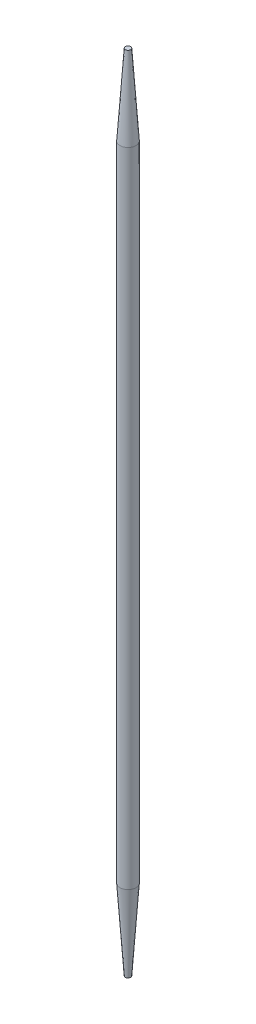
ISO-10303-21;
HEADER;
FILE_DESCRIPTION(('STEP AP214'),'2;1');
FILE_NAME('part.step','',(''),(''),'','','');
FILE_SCHEMA(('AUTOMOTIVE_DESIGN { 1 0 10303 214 1 1 1 1 }'));
ENDSEC;
DATA;
#1=APPLICATION_CONTEXT('core data for automotive mechanical design processes');
#2=APPLICATION_PROTOCOL_DEFINITION('international standard','automotive_design',2000,#1);
#3=PRODUCT_CONTEXT('',#1,'mechanical');
#4=PRODUCT('Part','Part','',(#3));
#5=PRODUCT_RELATED_PRODUCT_CATEGORY('part','',(#4));
#6=PRODUCT_DEFINITION_FORMATION('','',#4);
#7=PRODUCT_DEFINITION_CONTEXT('part definition',#1,'design');
#8=PRODUCT_DEFINITION('design','',#6,#7);
#9=PRODUCT_DEFINITION_SHAPE('','',#8);
#10=(LENGTH_UNIT() NAMED_UNIT(*) SI_UNIT(.MILLI.,.METRE.));
#11=(NAMED_UNIT(*) PLANE_ANGLE_UNIT() SI_UNIT($,.RADIAN.));
#12=(NAMED_UNIT(*) SI_UNIT($,.STERADIAN.) SOLID_ANGLE_UNIT());
#13=UNCERTAINTY_MEASURE_WITH_UNIT(LENGTH_MEASURE(1.E-05),#10,'distance_accuracy_value','');
#14=(GEOMETRIC_REPRESENTATION_CONTEXT(3) GLOBAL_UNCERTAINTY_ASSIGNED_CONTEXT((#13)) GLOBAL_UNIT_ASSIGNED_CONTEXT((#10,
#11,#12)) REPRESENTATION_CONTEXT('',''));
#15=CARTESIAN_POINT('',(0.,0.,0.));
#16=DIRECTION('',(0.,0.,1.));
#17=DIRECTION('',(1.,0.,0.));
#18=AXIS2_PLACEMENT_3D('',#15,#16,#17);
#19=CARTESIAN_POINT('',(0.,150.,0.));
#20=DIRECTION('',(0.,-1.,0.));
#21=DIRECTION('',(0.,0.,-1.));
#22=AXIS2_PLACEMENT_3D('',#19,#20,#21);
#23=CYLINDRICAL_SURFACE('',#22,1.5);
#24=CARTESIAN_POINT('',(0.,135.,0.));
#25=DIRECTION('',(0.,1.,0.));
#26=DIRECTION('',(0.,0.,1.));
#27=AXIS2_PLACEMENT_3D('',#24,#25,#26);
#28=CIRCLE('',#27,1.5);
#29=CARTESIAN_POINT('',(0.,135.,1.5));
#30=VERTEX_POINT('',#29);
#31=EDGE_CURVE('E48',#30,#30,#28,.F.);
#32=ORIENTED_EDGE('',*,*,#31,.T.);
#33=EDGE_LOOP('',(#32));
#34=FACE_BOUND('',#33,.T.);
#35=CARTESIAN_POINT('',(0.,15.0000000000009,0.));
#36=DIRECTION('',(0.,1.,0.));
#37=DIRECTION('',(0.,0.,1.));
#38=AXIS2_PLACEMENT_3D('',#35,#36,#37);
#39=CIRCLE('',#38,1.5);
#40=CARTESIAN_POINT('',(0.,15.0000000000009,1.5));
#41=VERTEX_POINT('',#40);
#42=EDGE_CURVE('E54',#41,#41,#39,.T.);
#43=ORIENTED_EDGE('',*,*,#42,.T.);
#44=EDGE_LOOP('',(#43));
#45=FACE_BOUND('',#44,.T.);
#46=ADVANCED_FACE('F39',(#34,#45),#23,.T.);
#47=CARTESIAN_POINT('',(0.,150.,0.));
#48=DIRECTION('',(0.,1.,0.));
#49=DIRECTION('',(0.,0.,1.));
#50=AXIS2_PLACEMENT_3D('',#47,#48,#49);
#51=PLANE('',#50);
#52=CARTESIAN_POINT('',(0.,150.,0.));
#53=DIRECTION('',(0.,1.,0.));
#54=DIRECTION('',(0.,0.,1.));
#55=AXIS2_PLACEMENT_3D('',#52,#53,#54);
#56=CIRCLE('',#55,0.499999999999895);
#57=CARTESIAN_POINT('',(0.,150.,0.499999999999895));
#58=VERTEX_POINT('',#57);
#59=EDGE_CURVE('E60',#58,#58,#56,.T.);
#60=ORIENTED_EDGE('',*,*,#59,.T.);
#61=EDGE_LOOP('',(#60));
#62=FACE_BOUND('',#61,.T.);
#63=ADVANCED_FACE('F68',(#62),#51,.T.);
#64=CARTESIAN_POINT('',(0.,0.,0.));
#65=DIRECTION('',(0.,1.,0.));
#66=DIRECTION('',(0.,0.,1.));
#67=AXIS2_PLACEMENT_3D('',#64,#65,#66);
#68=PLANE('',#67);
#69=CARTESIAN_POINT('',(0.,0.,0.));
#70=DIRECTION('',(0.,1.,0.));
#71=DIRECTION('',(0.,0.,1.));
#72=AXIS2_PLACEMENT_3D('',#69,#70,#71);
#73=CIRCLE('',#72,0.499999999999994);
#74=CARTESIAN_POINT('',(0.,0.,0.499999999999994));
#75=VERTEX_POINT('',#74);
#76=EDGE_CURVE('E10',#75,#75,#73,.F.);
#77=ORIENTED_EDGE('',*,*,#76,.T.);
#78=EDGE_LOOP('',(#77));
#79=FACE_BOUND('',#78,.T.);
#80=ADVANCED_FACE('F72',(#79),#68,.F.);
#81=CARTESIAN_POINT('',(0.,150.,0.));
#82=DIRECTION('',(0.,-1.,0.));
#83=DIRECTION('',(0.,0.,-1.));
#84=AXIS2_PLACEMENT_3D('',#81,#82,#83);
#85=CONICAL_SURFACE('',#84,0.499999999999895,0.0665681637758308);
#86=ORIENTED_EDGE('',*,*,#31,.F.);
#87=EDGE_LOOP('',(#86));
#88=FACE_BOUND('',#87,.T.);
#89=ORIENTED_EDGE('',*,*,#59,.F.);
#90=EDGE_LOOP('',(#89));
#91=FACE_BOUND('',#90,.T.);
#92=ADVANCED_FACE('F70',(#88,#91),#85,.T.);
#93=CARTESIAN_POINT('',(0.,15.0000000000009,0.));
#94=DIRECTION('',(0.,1.,0.));
#95=DIRECTION('',(0.,0.,1.));
#96=AXIS2_PLACEMENT_3D('',#93,#94,#95);
#97=CONICAL_SURFACE('',#96,1.5,0.0665681637758203);
#98=ORIENTED_EDGE('',*,*,#76,.F.);
#99=EDGE_LOOP('',(#98));
#100=FACE_BOUND('',#99,.T.);
#101=ORIENTED_EDGE('',*,*,#42,.F.);
#102=EDGE_LOOP('',(#101));
#103=FACE_BOUND('',#102,.T.);
#104=ADVANCED_FACE('F42',(#100,#103),#97,.T.);
#105=CLOSED_SHELL('',(#46,#63,#80,#92,#104));
#106=MANIFOLD_SOLID_BREP('B2',#105);
#107=ADVANCED_BREP_SHAPE_REPRESENTATION('',(#18,#106),#14);
#108=SHAPE_DEFINITION_REPRESENTATION(#9,#107);
ENDSEC;
END-ISO-10303-21;
